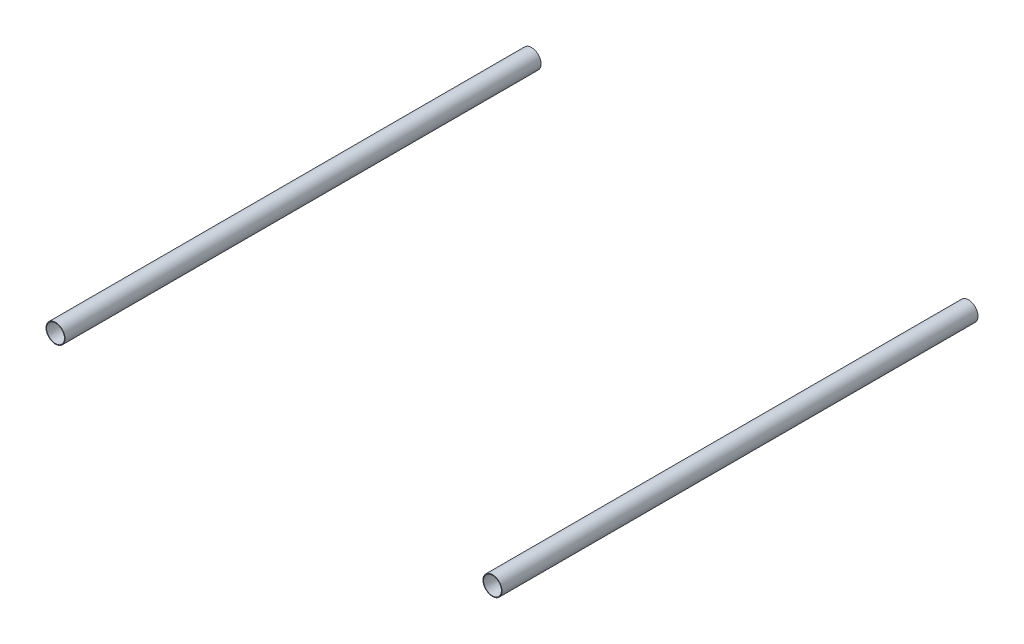
ISO-10303-21;
HEADER;
FILE_DESCRIPTION(('STEP AP214'),'2;1');
FILE_NAME('part.step','',(''),(''),'','','');
FILE_SCHEMA(('AUTOMOTIVE_DESIGN { 1 0 10303 214 1 1 1 1 }'));
ENDSEC;
DATA;
#1=APPLICATION_CONTEXT('core data for automotive mechanical design processes');
#2=APPLICATION_PROTOCOL_DEFINITION('international standard','automotive_design',2000,#1);
#3=PRODUCT_CONTEXT('',#1,'mechanical');
#4=PRODUCT('Part','Part','',(#3));
#5=PRODUCT_RELATED_PRODUCT_CATEGORY('part','',(#4));
#6=PRODUCT_DEFINITION_FORMATION('','',#4);
#7=PRODUCT_DEFINITION_CONTEXT('part definition',#1,'design');
#8=PRODUCT_DEFINITION('design','',#6,#7);
#9=PRODUCT_DEFINITION_SHAPE('','',#8);
#10=(LENGTH_UNIT() NAMED_UNIT(*) SI_UNIT(.MILLI.,.METRE.));
#11=(NAMED_UNIT(*) PLANE_ANGLE_UNIT() SI_UNIT($,.RADIAN.));
#12=(NAMED_UNIT(*) SI_UNIT($,.STERADIAN.) SOLID_ANGLE_UNIT());
#13=UNCERTAINTY_MEASURE_WITH_UNIT(LENGTH_MEASURE(1.E-05),#10,'distance_accuracy_value','');
#14=(GEOMETRIC_REPRESENTATION_CONTEXT(3) GLOBAL_UNCERTAINTY_ASSIGNED_CONTEXT((#13)) GLOBAL_UNIT_ASSIGNED_CONTEXT((#10,
#11,#12)) REPRESENTATION_CONTEXT('',''));
#15=CARTESIAN_POINT('',(0.,0.,0.));
#16=DIRECTION('',(0.,0.,1.));
#17=DIRECTION('',(1.,0.,0.));
#18=AXIS2_PLACEMENT_3D('',#15,#16,#17);
#19=CARTESIAN_POINT('',(-2295.,-2.81056440404318E-13,2500.));
#20=DIRECTION('',(0.,0.,1.));
#21=DIRECTION('',(1.,0.,0.));
#22=AXIS2_PLACEMENT_3D('',#19,#20,#21);
#23=PLANE('',#22);
#24=CARTESIAN_POINT('',(-2295.,-2.81056440404318E-13,2500.));
#25=DIRECTION('',(0.,0.,1.));
#26=DIRECTION('',(1.,0.,0.));
#27=AXIS2_PLACEMENT_3D('',#24,#25,#26);
#28=CIRCLE('',#27,50.);
#29=CARTESIAN_POINT('',(-2245.,-2.81056440404318E-13,2500.));
#30=VERTEX_POINT('',#29);
#31=EDGE_CURVE('E12',#30,#30,#28,.T.);
#32=ORIENTED_EDGE('',*,*,#31,.T.);
#33=EDGE_LOOP('',(#32));
#34=FACE_BOUND('',#33,.T.);
#35=CARTESIAN_POINT('',(-2295.,-2.81056440404318E-13,2500.));
#36=DIRECTION('',(0.,0.,1.));
#37=DIRECTION('',(1.,0.,0.));
#38=AXIS2_PLACEMENT_3D('',#35,#36,#37);
#39=CIRCLE('',#38,47.);
#40=CARTESIAN_POINT('',(-2248.,-2.81056440404318E-13,2500.));
#41=VERTEX_POINT('',#40);
#42=EDGE_CURVE('E66',#41,#41,#39,.T.);
#43=ORIENTED_EDGE('',*,*,#42,.F.);
#44=EDGE_LOOP('',(#43));
#45=FACE_BOUND('',#44,.T.);
#46=ADVANCED_FACE('F55',(#34,#45),#23,.T.);
#47=CARTESIAN_POINT('',(-2295.,-2.81056440404318E-13,0.));
#48=DIRECTION('',(0.,0.,1.));
#49=DIRECTION('',(1.,0.,0.));
#50=AXIS2_PLACEMENT_3D('',#47,#48,#49);
#51=PLANE('',#50);
#52=CARTESIAN_POINT('',(-2295.,-2.81056440404318E-13,0.));
#53=DIRECTION('',(0.,0.,1.));
#54=DIRECTION('',(1.,0.,0.));
#55=AXIS2_PLACEMENT_3D('',#52,#53,#54);
#56=CIRCLE('',#55,50.);
#57=CARTESIAN_POINT('',(-2245.,-2.81056440404318E-13,0.));
#58=VERTEX_POINT('',#57);
#59=EDGE_CURVE('E59',#58,#58,#56,.T.);
#60=ORIENTED_EDGE('',*,*,#59,.F.);
#61=EDGE_LOOP('',(#60));
#62=FACE_BOUND('',#61,.T.);
#63=CARTESIAN_POINT('',(-2295.,-2.81056440404318E-13,0.));
#64=DIRECTION('',(0.,0.,1.));
#65=DIRECTION('',(1.,0.,0.));
#66=AXIS2_PLACEMENT_3D('',#63,#64,#65);
#67=CIRCLE('',#66,47.);
#68=CARTESIAN_POINT('',(-2248.,-2.81056440404318E-13,0.));
#69=VERTEX_POINT('',#68);
#70=EDGE_CURVE('E68',#69,#69,#67,.T.);
#71=ORIENTED_EDGE('',*,*,#70,.T.);
#72=EDGE_LOOP('',(#71));
#73=FACE_BOUND('',#72,.T.);
#74=ADVANCED_FACE('F78',(#62,#73),#51,.F.);
#75=CARTESIAN_POINT('',(-2295.,-2.81056440404318E-13,2500.));
#76=DIRECTION('',(0.,0.,-1.));
#77=DIRECTION('',(-1.,0.,0.));
#78=AXIS2_PLACEMENT_3D('',#75,#76,#77);
#79=CYLINDRICAL_SURFACE('',#78,50.);
#80=ORIENTED_EDGE('',*,*,#31,.F.);
#81=EDGE_LOOP('',(#80));
#82=FACE_BOUND('',#81,.T.);
#83=ORIENTED_EDGE('',*,*,#59,.T.);
#84=EDGE_LOOP('',(#83));
#85=FACE_BOUND('',#84,.T.);
#86=ADVANCED_FACE('F57',(#82,#85),#79,.T.);
#87=CARTESIAN_POINT('',(-2295.,-2.81056440404318E-13,2500.));
#88=DIRECTION('',(0.,0.,-1.));
#89=DIRECTION('',(-1.,0.,0.));
#90=AXIS2_PLACEMENT_3D('',#87,#88,#89);
#91=CYLINDRICAL_SURFACE('',#90,47.);
#92=ORIENTED_EDGE('',*,*,#42,.T.);
#93=EDGE_LOOP('',(#92));
#94=FACE_BOUND('',#93,.T.);
#95=ORIENTED_EDGE('',*,*,#70,.F.);
#96=EDGE_LOOP('',(#95));
#97=FACE_BOUND('',#96,.T.);
#98=ADVANCED_FACE('F74',(#94,#97),#91,.F.);
#99=CLOSED_SHELL('',(#46,#74,#86,#98));
#100=MANIFOLD_SOLID_BREP('B2',#99);
#101=CARTESIAN_POINT('',(0.,0.,2500.));
#102=DIRECTION('',(0.,0.,1.));
#103=DIRECTION('',(1.,0.,0.));
#104=AXIS2_PLACEMENT_3D('',#101,#102,#103);
#105=PLANE('',#104);
#106=CARTESIAN_POINT('',(0.,0.,2500.));
#107=DIRECTION('',(0.,0.,1.));
#108=DIRECTION('',(1.,0.,0.));
#109=AXIS2_PLACEMENT_3D('',#106,#107,#108);
#110=CIRCLE('',#109,50.);
#111=CARTESIAN_POINT('',(50.,0.,2500.));
#112=VERTEX_POINT('',#111);
#113=EDGE_CURVE('E54',#112,#112,#110,.T.);
#114=ORIENTED_EDGE('',*,*,#113,.T.);
#115=EDGE_LOOP('',(#114));
#116=FACE_BOUND('',#115,.T.);
#117=CARTESIAN_POINT('',(0.,0.,2500.));
#118=DIRECTION('',(0.,0.,1.));
#119=DIRECTION('',(1.,0.,0.));
#120=AXIS2_PLACEMENT_3D('',#117,#118,#119);
#121=CIRCLE('',#120,47.);
#122=CARTESIAN_POINT('',(47.,0.,2500.));
#123=VERTEX_POINT('',#122);
#124=EDGE_CURVE('E120',#123,#123,#121,.T.);
#125=ORIENTED_EDGE('',*,*,#124,.F.);
#126=EDGE_LOOP('',(#125));
#127=FACE_BOUND('',#126,.T.);
#128=ADVANCED_FACE('F109',(#116,#127),#105,.T.);
#129=CARTESIAN_POINT('',(0.,0.,0.));
#130=DIRECTION('',(0.,0.,1.));
#131=DIRECTION('',(1.,0.,0.));
#132=AXIS2_PLACEMENT_3D('',#129,#130,#131);
#133=PLANE('',#132);
#134=CARTESIAN_POINT('',(0.,0.,0.));
#135=DIRECTION('',(0.,0.,1.));
#136=DIRECTION('',(1.,0.,0.));
#137=AXIS2_PLACEMENT_3D('',#134,#135,#136);
#138=CIRCLE('',#137,50.);
#139=CARTESIAN_POINT('',(50.,0.,0.));
#140=VERTEX_POINT('',#139);
#141=EDGE_CURVE('E113',#140,#140,#138,.T.);
#142=ORIENTED_EDGE('',*,*,#141,.F.);
#143=EDGE_LOOP('',(#142));
#144=FACE_BOUND('',#143,.T.);
#145=CARTESIAN_POINT('',(0.,0.,0.));
#146=DIRECTION('',(0.,0.,1.));
#147=DIRECTION('',(1.,0.,0.));
#148=AXIS2_PLACEMENT_3D('',#145,#146,#147);
#149=CIRCLE('',#148,47.);
#150=CARTESIAN_POINT('',(47.,0.,0.));
#151=VERTEX_POINT('',#150);
#152=EDGE_CURVE('E122',#151,#151,#149,.T.);
#153=ORIENTED_EDGE('',*,*,#152,.T.);
#154=EDGE_LOOP('',(#153));
#155=FACE_BOUND('',#154,.T.);
#156=ADVANCED_FACE('F132',(#144,#155),#133,.F.);
#157=CARTESIAN_POINT('',(0.,0.,2500.));
#158=DIRECTION('',(0.,0.,-1.));
#159=DIRECTION('',(-1.,0.,0.));
#160=AXIS2_PLACEMENT_3D('',#157,#158,#159);
#161=CYLINDRICAL_SURFACE('',#160,50.);
#162=ORIENTED_EDGE('',*,*,#113,.F.);
#163=EDGE_LOOP('',(#162));
#164=FACE_BOUND('',#163,.T.);
#165=ORIENTED_EDGE('',*,*,#141,.T.);
#166=EDGE_LOOP('',(#165));
#167=FACE_BOUND('',#166,.T.);
#168=ADVANCED_FACE('F111',(#164,#167),#161,.T.);
#169=CARTESIAN_POINT('',(0.,0.,2500.));
#170=DIRECTION('',(0.,0.,-1.));
#171=DIRECTION('',(-1.,0.,0.));
#172=AXIS2_PLACEMENT_3D('',#169,#170,#171);
#173=CYLINDRICAL_SURFACE('',#172,47.);
#174=ORIENTED_EDGE('',*,*,#124,.T.);
#175=EDGE_LOOP('',(#174));
#176=FACE_BOUND('',#175,.T.);
#177=ORIENTED_EDGE('',*,*,#152,.F.);
#178=EDGE_LOOP('',(#177));
#179=FACE_BOUND('',#178,.T.);
#180=ADVANCED_FACE('F128',(#176,#179),#173,.F.);
#181=CLOSED_SHELL('',(#128,#156,#168,#180));
#182=MANIFOLD_SOLID_BREP('B7',#181);
#183=ADVANCED_BREP_SHAPE_REPRESENTATION('',(#18,#100,#182),#14);
#184=SHAPE_DEFINITION_REPRESENTATION(#9,#183);
ENDSEC;
END-ISO-10303-21;
